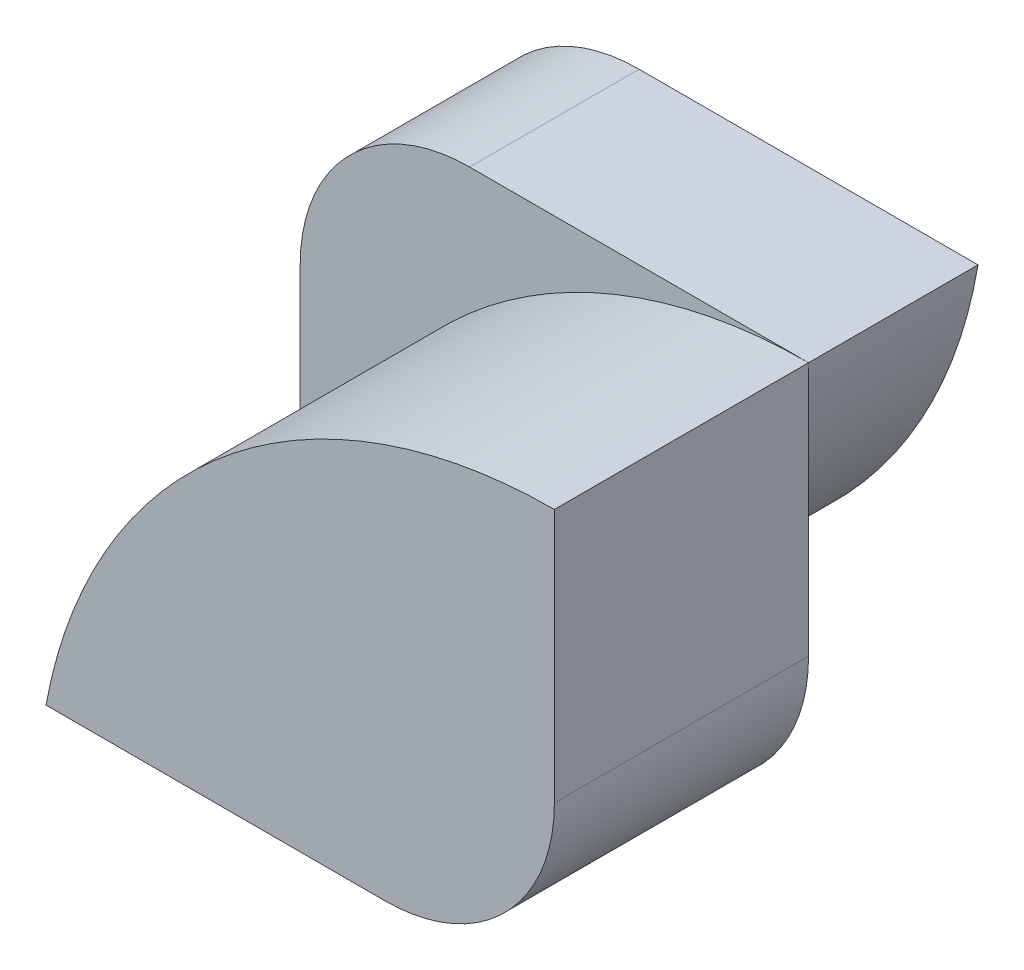
ISO-10303-21;
HEADER;
FILE_DESCRIPTION(('STEP AP214'),'2;1');
FILE_NAME('part.step','',(''),(''),'','','');
FILE_SCHEMA(('AUTOMOTIVE_DESIGN { 1 0 10303 214 1 1 1 1 }'));
ENDSEC;
DATA;
#1=APPLICATION_CONTEXT('core data for automotive mechanical design processes');
#2=APPLICATION_PROTOCOL_DEFINITION('international standard','automotive_design',2000,#1);
#3=PRODUCT_CONTEXT('',#1,'mechanical');
#4=PRODUCT('Part','Part','',(#3));
#5=PRODUCT_RELATED_PRODUCT_CATEGORY('part','',(#4));
#6=PRODUCT_DEFINITION_FORMATION('','',#4);
#7=PRODUCT_DEFINITION_CONTEXT('part definition',#1,'design');
#8=PRODUCT_DEFINITION('design','',#6,#7);
#9=PRODUCT_DEFINITION_SHAPE('','',#8);
#10=(LENGTH_UNIT() NAMED_UNIT(*) SI_UNIT(.MILLI.,.METRE.));
#11=(NAMED_UNIT(*) PLANE_ANGLE_UNIT() SI_UNIT($,.RADIAN.));
#12=(NAMED_UNIT(*) SI_UNIT($,.STERADIAN.) SOLID_ANGLE_UNIT());
#13=UNCERTAINTY_MEASURE_WITH_UNIT(LENGTH_MEASURE(1.E-05),#10,'distance_accuracy_value','');
#14=(GEOMETRIC_REPRESENTATION_CONTEXT(3) GLOBAL_UNCERTAINTY_ASSIGNED_CONTEXT((#13)) GLOBAL_UNIT_ASSIGNED_CONTEXT((#10,
#11,#12)) REPRESENTATION_CONTEXT('',''));
#15=CARTESIAN_POINT('',(0.,0.,0.));
#16=DIRECTION('',(0.,0.,1.));
#17=DIRECTION('',(1.,0.,0.));
#18=AXIS2_PLACEMENT_3D('',#15,#16,#17);
#19=CARTESIAN_POINT('',(-29.580893628869,4.99707235464285,10.));
#20=DIRECTION('',(0.,0.,1.));
#21=DIRECTION('',(1.,0.,0.));
#22=AXIS2_PLACEMENT_3D('',#19,#20,#21);
#23=PLANE('',#22);
#24=CARTESIAN_POINT('',(0.,-30.5,10.));
#25=DIRECTION('',(0.,0.,1.));
#26=DIRECTION('',(-1.,0.,0.));
#27=AXIS2_PLACEMENT_3D('',#24,#25,#26);
#28=CIRCLE('',#27,30.5);
#29=CARTESIAN_POINT('',(0.,0.,10.));
#30=VERTEX_POINT('',#29);
#31=CARTESIAN_POINT('',(-30.,-25.,10.));
#32=VERTEX_POINT('',#31);
#33=EDGE_CURVE('E83',#30,#32,#28,.T.);
#34=ORIENTED_EDGE('',*,*,#33,.F.);
#35=DIRECTION('',(-1.,0.,0.));
#36=VECTOR('',#35,1.);
#37=CARTESIAN_POINT('',(0.,0.,10.));
#38=LINE('',#37,#36);
#39=CARTESIAN_POINT('',(-20.,0.,10.));
#40=VERTEX_POINT('',#39);
#41=EDGE_CURVE('E168',#30,#40,#38,.T.);
#42=ORIENTED_EDGE('',*,*,#41,.T.);
#43=CARTESIAN_POINT('',(-20.,-10.,10.));
#44=DIRECTION('',(0.,0.,1.));
#45=DIRECTION('',(1.,0.,0.));
#46=AXIS2_PLACEMENT_3D('',#43,#44,#45);
#47=CIRCLE('',#46,10.);
#48=CARTESIAN_POINT('',(-30.,-10.,10.));
#49=VERTEX_POINT('',#48);
#50=EDGE_CURVE('E219',#40,#49,#47,.T.);
#51=ORIENTED_EDGE('',*,*,#50,.T.);
#52=DIRECTION('',(0.,-1.,0.));
#53=VECTOR('',#52,1.);
#54=CARTESIAN_POINT('',(-30.,-10.,10.));
#55=LINE('',#54,#53);
#56=EDGE_CURVE('E54',#49,#32,#55,.T.);
#57=ORIENTED_EDGE('',*,*,#56,.T.);
#58=EDGE_LOOP('',(#34,#42,#51,#57));
#59=FACE_BOUND('',#58,.T.);
#60=ADVANCED_FACE('F33',(#59),#23,.T.);
#61=CARTESIAN_POINT('',(-29.580893628869,4.99707235464285,10.));
#62=DIRECTION('',(0.,0.,-1.));
#63=DIRECTION('',(-1.,0.,0.));
#64=AXIS2_PLACEMENT_3D('',#61,#62,#63);
#65=CYLINDRICAL_SURFACE('',#64,30.);
#66=CARTESIAN_POINT('',(-29.580893628869,4.99707235464285,0.));
#67=DIRECTION('',(0.,0.,1.));
#68=DIRECTION('',(1.,0.,0.));
#69=AXIS2_PLACEMENT_3D('',#66,#67,#68);
#70=CIRCLE('',#69,30.);
#71=CARTESIAN_POINT('',(-30.,-25.,0.));
#72=VERTEX_POINT('',#71);
#73=CARTESIAN_POINT('',(0.,0.,0.));
#74=VERTEX_POINT('',#73);
#75=EDGE_CURVE('E131',#72,#74,#70,.T.);
#76=ORIENTED_EDGE('',*,*,#75,.T.);
#77=DIRECTION('',(0.,0.,-1.));
#78=VECTOR('',#77,1.);
#79=CARTESIAN_POINT('',(0.,0.,10.));
#80=LINE('',#79,#78);
#81=EDGE_CURVE('E11',#30,#74,#80,.T.);
#82=ORIENTED_EDGE('',*,*,#81,.F.);
#83=CARTESIAN_POINT('',(-29.580893628869,4.99707235464285,10.));
#84=DIRECTION('',(0.,0.,1.));
#85=DIRECTION('',(1.,0.,0.));
#86=AXIS2_PLACEMENT_3D('',#83,#84,#85);
#87=CIRCLE('',#86,30.);
#88=CARTESIAN_POINT('',(-29.1617872577383,-25.,10.));
#89=VERTEX_POINT('',#88);
#90=EDGE_CURVE('E165',#89,#30,#87,.T.);
#91=ORIENTED_EDGE('',*,*,#90,.F.);
#92=CARTESIAN_POINT('',(-30.,-25.,10.));
#93=DIRECTION('',(1.,0.,0.));
#94=VECTOR('',#93,1.);
#95=LINE('',#92,#94);
#96=EDGE_CURVE('E156',#32,#89,#95,.T.);
#97=ORIENTED_EDGE('',*,*,#96,.F.);
#98=DIRECTION('',(0.,0.,-1.));
#99=VECTOR('',#98,1.);
#100=CARTESIAN_POINT('',(-30.,-25.,10.));
#101=LINE('',#100,#99);
#102=EDGE_CURVE('E173',#32,#72,#101,.T.);
#103=ORIENTED_EDGE('',*,*,#102,.T.);
#104=EDGE_LOOP('',(#76,#82,#91,#97,#103));
#105=FACE_BOUND('',#104,.T.);
#106=ADVANCED_FACE('F35',(#105),#65,.T.);
#107=CARTESIAN_POINT('',(0.,0.,10.));
#108=DIRECTION('',(0.,-1.,0.));
#109=DIRECTION('',(1.,0.,0.));
#110=AXIS2_PLACEMENT_3D('',#107,#108,#109);
#111=PLANE('',#110);
#112=DIRECTION('',(-1.,0.,0.));
#113=VECTOR('',#112,1.);
#114=CARTESIAN_POINT('',(0.,0.,0.));
#115=LINE('',#114,#113);
#116=CARTESIAN_POINT('',(-20.,0.,0.));
#117=VERTEX_POINT('',#116);
#118=EDGE_CURVE('E134',#74,#117,#115,.T.);
#119=ORIENTED_EDGE('',*,*,#118,.T.);
#120=DIRECTION('',(0.,0.,-1.));
#121=VECTOR('',#120,1.);
#122=CARTESIAN_POINT('',(-20.,0.,10.));
#123=LINE('',#122,#121);
#124=EDGE_CURVE('E45',#40,#117,#123,.T.);
#125=ORIENTED_EDGE('',*,*,#124,.F.);
#126=ORIENTED_EDGE('',*,*,#41,.F.);
#127=ORIENTED_EDGE('',*,*,#81,.T.);
#128=EDGE_LOOP('',(#119,#125,#126,#127));
#129=FACE_BOUND('',#128,.T.);
#130=ADVANCED_FACE('F200',(#129),#111,.F.);
#131=CARTESIAN_POINT('',(-20.,-10.,10.));
#132=DIRECTION('',(0.,0.,-1.));
#133=DIRECTION('',(-1.,0.,0.));
#134=AXIS2_PLACEMENT_3D('',#131,#132,#133);
#135=CYLINDRICAL_SURFACE('',#134,10.);
#136=CARTESIAN_POINT('',(-20.,-10.,0.));
#137=DIRECTION('',(0.,0.,1.));
#138=DIRECTION('',(1.,0.,0.));
#139=AXIS2_PLACEMENT_3D('',#136,#137,#138);
#140=CIRCLE('',#139,10.);
#141=CARTESIAN_POINT('',(-30.,-10.,0.));
#142=VERTEX_POINT('',#141);
#143=EDGE_CURVE('E72',#117,#142,#140,.T.);
#144=ORIENTED_EDGE('',*,*,#143,.T.);
#145=DIRECTION('',(0.,0.,-1.));
#146=VECTOR('',#145,1.);
#147=CARTESIAN_POINT('',(-30.,-10.,10.));
#148=LINE('',#147,#146);
#149=EDGE_CURVE('E220',#49,#142,#148,.T.);
#150=ORIENTED_EDGE('',*,*,#149,.F.);
#151=ORIENTED_EDGE('',*,*,#50,.F.);
#152=ORIENTED_EDGE('',*,*,#124,.T.);
#153=EDGE_LOOP('',(#144,#150,#151,#152));
#154=FACE_BOUND('',#153,.T.);
#155=ADVANCED_FACE('F210',(#154),#135,.T.);
#156=CARTESIAN_POINT('',(-30.,-10.,10.));
#157=DIRECTION('',(1.,0.,0.));
#158=DIRECTION('',(0.,0.,-1.));
#159=AXIS2_PLACEMENT_3D('',#156,#157,#158);
#160=PLANE('',#159);
#161=DIRECTION('',(0.,-1.,0.));
#162=VECTOR('',#161,1.);
#163=CARTESIAN_POINT('',(-30.,-10.,0.));
#164=LINE('',#163,#162);
#165=EDGE_CURVE('E78',#142,#72,#164,.T.);
#166=ORIENTED_EDGE('',*,*,#165,.T.);
#167=ORIENTED_EDGE('',*,*,#102,.F.);
#168=ORIENTED_EDGE('',*,*,#56,.F.);
#169=ORIENTED_EDGE('',*,*,#149,.T.);
#170=EDGE_LOOP('',(#166,#167,#168,#169));
#171=FACE_BOUND('',#170,.T.);
#172=ADVANCED_FACE('F206',(#171),#160,.F.);
#173=CARTESIAN_POINT('',(-29.580893628869,4.99707235464285,0.));
#174=DIRECTION('',(0.,0.,1.));
#175=DIRECTION('',(1.,0.,0.));
#176=AXIS2_PLACEMENT_3D('',#173,#174,#175);
#177=PLANE('',#176);
#178=ORIENTED_EDGE('',*,*,#75,.F.);
#179=ORIENTED_EDGE('',*,*,#165,.F.);
#180=ORIENTED_EDGE('',*,*,#143,.F.);
#181=ORIENTED_EDGE('',*,*,#118,.F.);
#182=EDGE_LOOP('',(#178,#179,#180,#181));
#183=FACE_BOUND('',#182,.T.);
#184=ADVANCED_FACE('F203',(#183),#177,.F.);
#185=CARTESIAN_POINT('',(0.,-30.5,25.));
#186=DIRECTION('',(0.,0.,-1.));
#187=DIRECTION('',(-1.,0.,0.));
#188=AXIS2_PLACEMENT_3D('',#185,#186,#187);
#189=CYLINDRICAL_SURFACE('',#188,30.5);
#190=ORIENTED_EDGE('',*,*,#33,.T.);
#191=DIRECTION('',(0.,0.,-1.));
#192=VECTOR('',#191,1.);
#193=CARTESIAN_POINT('',(-30.,-25.,25.));
#194=LINE('',#193,#192);
#195=CARTESIAN_POINT('',(-30.,-25.,25.));
#196=VERTEX_POINT('',#195);
#197=EDGE_CURVE('E113',#196,#32,#194,.T.);
#198=ORIENTED_EDGE('',*,*,#197,.F.);
#199=CARTESIAN_POINT('',(0.,-30.5,25.));
#200=DIRECTION('',(0.,0.,1.));
#201=DIRECTION('',(-1.,0.,0.));
#202=AXIS2_PLACEMENT_3D('',#199,#200,#201);
#203=CIRCLE('',#202,30.5);
#204=CARTESIAN_POINT('',(0.,0.,25.));
#205=VERTEX_POINT('',#204);
#206=EDGE_CURVE('E119',#205,#196,#203,.T.);
#207=ORIENTED_EDGE('',*,*,#206,.F.);
#208=DIRECTION('',(0.,0.,-1.));
#209=VECTOR('',#208,1.);
#210=CARTESIAN_POINT('',(0.,0.,25.));
#211=LINE('',#210,#209);
#212=EDGE_CURVE('E159',#205,#30,#211,.T.);
#213=ORIENTED_EDGE('',*,*,#212,.T.);
#214=EDGE_LOOP('',(#190,#198,#207,#213));
#215=FACE_BOUND('',#214,.T.);
#216=ADVANCED_FACE('F130',(#215),#189,.T.);
#217=CARTESIAN_POINT('',(-10.,-25.,25.));
#218=DIRECTION('',(0.,1.,0.));
#219=DIRECTION('',(0.,0.,1.));
#220=AXIS2_PLACEMENT_3D('',#217,#218,#219);
#221=PLANE('',#220);
#222=ORIENTED_EDGE('',*,*,#96,.T.);
#223=DIRECTION('',(1.,0.,0.));
#224=VECTOR('',#223,1.);
#225=CARTESIAN_POINT('',(-10.,-25.,10.));
#226=LINE('',#225,#224);
#227=CARTESIAN_POINT('',(-10.,-25.,10.));
#228=VERTEX_POINT('',#227);
#229=EDGE_CURVE('E148',#89,#228,#226,.T.);
#230=ORIENTED_EDGE('',*,*,#229,.T.);
#231=DIRECTION('',(0.,0.,-1.));
#232=VECTOR('',#231,1.);
#233=CARTESIAN_POINT('',(-10.,-25.,25.));
#234=LINE('',#233,#232);
#235=CARTESIAN_POINT('',(-10.,-25.,25.));
#236=VERTEX_POINT('',#235);
#237=EDGE_CURVE('E115',#236,#228,#234,.T.);
#238=ORIENTED_EDGE('',*,*,#237,.F.);
#239=DIRECTION('',(1.,0.,0.));
#240=VECTOR('',#239,1.);
#241=CARTESIAN_POINT('',(-10.,-25.,25.));
#242=LINE('',#241,#240);
#243=EDGE_CURVE('E108',#196,#236,#242,.T.);
#244=ORIENTED_EDGE('',*,*,#243,.F.);
#245=ORIENTED_EDGE('',*,*,#197,.T.);
#246=EDGE_LOOP('',(#222,#230,#238,#244,#245));
#247=FACE_BOUND('',#246,.T.);
#248=ADVANCED_FACE('F111',(#247),#221,.F.);
#249=CARTESIAN_POINT('',(-10.,-15.,25.));
#250=DIRECTION('',(0.,0.,-1.));
#251=DIRECTION('',(-1.,0.,0.));
#252=AXIS2_PLACEMENT_3D('',#249,#250,#251);
#253=CYLINDRICAL_SURFACE('',#252,10.);
#254=CARTESIAN_POINT('',(-10.,-15.,10.));
#255=DIRECTION('',(0.,0.,1.));
#256=DIRECTION('',(1.,0.,0.));
#257=AXIS2_PLACEMENT_3D('',#254,#255,#256);
#258=CIRCLE('',#257,10.);
#259=CARTESIAN_POINT('',(0.,-15.,10.));
#260=VERTEX_POINT('',#259);
#261=EDGE_CURVE('E154',#228,#260,#258,.T.);
#262=ORIENTED_EDGE('',*,*,#261,.T.);
#263=DIRECTION('',(0.,0.,-1.));
#264=VECTOR('',#263,1.);
#265=CARTESIAN_POINT('',(0.,-15.,25.));
#266=LINE('',#265,#264);
#267=CARTESIAN_POINT('',(0.,-15.,25.));
#268=VERTEX_POINT('',#267);
#269=EDGE_CURVE('E136',#268,#260,#266,.T.);
#270=ORIENTED_EDGE('',*,*,#269,.F.);
#271=CARTESIAN_POINT('',(-10.,-15.,25.));
#272=DIRECTION('',(0.,0.,1.));
#273=DIRECTION('',(1.,0.,0.));
#274=AXIS2_PLACEMENT_3D('',#271,#272,#273);
#275=CIRCLE('',#274,10.);
#276=EDGE_CURVE('E118',#236,#268,#275,.T.);
#277=ORIENTED_EDGE('',*,*,#276,.F.);
#278=ORIENTED_EDGE('',*,*,#237,.T.);
#279=EDGE_LOOP('',(#262,#270,#277,#278));
#280=FACE_BOUND('',#279,.T.);
#281=ADVANCED_FACE('F180',(#280),#253,.T.);
#282=CARTESIAN_POINT('',(0.,0.,25.));
#283=DIRECTION('',(-1.,0.,0.));
#284=DIRECTION('',(0.,-1.,0.));
#285=AXIS2_PLACEMENT_3D('',#282,#283,#284);
#286=PLANE('',#285);
#287=DIRECTION('',(0.,1.,0.));
#288=VECTOR('',#287,1.);
#289=CARTESIAN_POINT('',(0.,0.,10.));
#290=LINE('',#289,#288);
#291=EDGE_CURVE('E128',#260,#30,#290,.T.);
#292=ORIENTED_EDGE('',*,*,#291,.T.);
#293=ORIENTED_EDGE('',*,*,#212,.F.);
#294=DIRECTION('',(0.,1.,0.));
#295=VECTOR('',#294,1.);
#296=CARTESIAN_POINT('',(0.,0.,25.));
#297=LINE('',#296,#295);
#298=EDGE_CURVE('E124',#268,#205,#297,.T.);
#299=ORIENTED_EDGE('',*,*,#298,.F.);
#300=ORIENTED_EDGE('',*,*,#269,.T.);
#301=EDGE_LOOP('',(#292,#293,#299,#300));
#302=FACE_BOUND('',#301,.T.);
#303=ADVANCED_FACE('F185',(#302),#286,.F.);
#304=CARTESIAN_POINT('',(0.,-30.5,25.));
#305=DIRECTION('',(0.,0.,-1.));
#306=DIRECTION('',(-1.,0.,0.));
#307=AXIS2_PLACEMENT_3D('',#304,#305,#306);
#308=PLANE('',#307);
#309=ORIENTED_EDGE('',*,*,#206,.T.);
#310=ORIENTED_EDGE('',*,*,#243,.T.);
#311=ORIENTED_EDGE('',*,*,#276,.T.);
#312=ORIENTED_EDGE('',*,*,#298,.T.);
#313=EDGE_LOOP('',(#309,#310,#311,#312));
#314=FACE_BOUND('',#313,.T.);
#315=ADVANCED_FACE('F122',(#314),#308,.F.);
#316=CARTESIAN_POINT('',(0.,-30.5,10.));
#317=DIRECTION('',(0.,0.,-1.));
#318=DIRECTION('',(-1.,0.,0.));
#319=AXIS2_PLACEMENT_3D('',#316,#317,#318);
#320=PLANE('',#319);
#321=ORIENTED_EDGE('',*,*,#229,.F.);
#322=ORIENTED_EDGE('',*,*,#90,.T.);
#323=ORIENTED_EDGE('',*,*,#291,.F.);
#324=ORIENTED_EDGE('',*,*,#261,.F.);
#325=EDGE_LOOP('',(#321,#322,#323,#324));
#326=FACE_BOUND('',#325,.T.);
#327=ADVANCED_FACE('F183',(#326),#320,.T.);
#328=CLOSED_SHELL('',(#60,#106,#130,#155,#172,#184,#216,#248,#281,#303,#315,#327));
#329=MANIFOLD_SOLID_BREP('B2',#328);
#330=ADVANCED_BREP_SHAPE_REPRESENTATION('',(#18,#329),#14);
#331=SHAPE_DEFINITION_REPRESENTATION(#9,#330);
ENDSEC;
END-ISO-10303-21;
